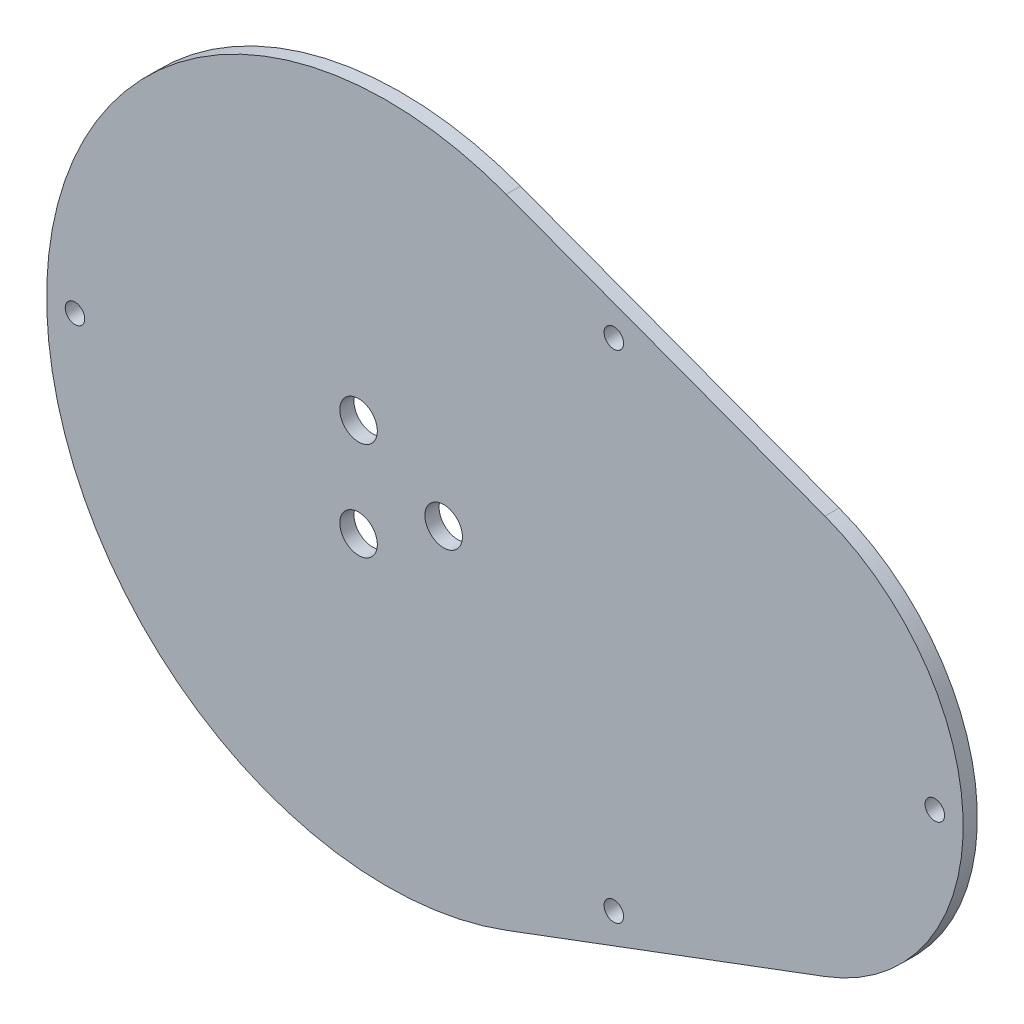
ISO-10303-21;
HEADER;
FILE_DESCRIPTION(('STEP AP214'),'2;1');
FILE_NAME('part.step','',(''),(''),'','','');
FILE_SCHEMA(('AUTOMOTIVE_DESIGN { 1 0 10303 214 1 1 1 1 }'));
ENDSEC;
DATA;
#1=APPLICATION_CONTEXT('core data for automotive mechanical design processes');
#2=APPLICATION_PROTOCOL_DEFINITION('international standard','automotive_design',2000,#1);
#3=PRODUCT_CONTEXT('',#1,'mechanical');
#4=PRODUCT('Part','Part','',(#3));
#5=PRODUCT_RELATED_PRODUCT_CATEGORY('part','',(#4));
#6=PRODUCT_DEFINITION_FORMATION('','',#4);
#7=PRODUCT_DEFINITION_CONTEXT('part definition',#1,'design');
#8=PRODUCT_DEFINITION('design','',#6,#7);
#9=PRODUCT_DEFINITION_SHAPE('','',#8);
#10=(LENGTH_UNIT() NAMED_UNIT(*) SI_UNIT(.MILLI.,.METRE.));
#11=(NAMED_UNIT(*) PLANE_ANGLE_UNIT() SI_UNIT($,.RADIAN.));
#12=(NAMED_UNIT(*) SI_UNIT($,.STERADIAN.) SOLID_ANGLE_UNIT());
#13=UNCERTAINTY_MEASURE_WITH_UNIT(LENGTH_MEASURE(1.E-05),#10,'distance_accuracy_value','');
#14=(GEOMETRIC_REPRESENTATION_CONTEXT(3) GLOBAL_UNCERTAINTY_ASSIGNED_CONTEXT((#13)) GLOBAL_UNIT_ASSIGNED_CONTEXT((#10,
#11,#12)) REPRESENTATION_CONTEXT('',''));
#15=CARTESIAN_POINT('',(0.,0.,0.));
#16=DIRECTION('',(0.,0.,1.));
#17=DIRECTION('',(1.,0.,0.));
#18=AXIS2_PLACEMENT_3D('',#15,#16,#17);
#19=CARTESIAN_POINT('',(0.,0.,1.5875));
#20=DIRECTION('',(0.,0.,1.));
#21=DIRECTION('',(1.,0.,0.));
#22=AXIS2_PLACEMENT_3D('',#19,#20,#21);
#23=PLANE('',#22);
#24=CARTESIAN_POINT('',(-3.175,-5.49926131403118,1.5875));
#25=DIRECTION('',(0.,0.,1.));
#26=DIRECTION('',(1.,0.,0.));
#27=AXIS2_PLACEMENT_3D('',#24,#25,#26);
#28=CIRCLE('',#27,2.1);
#29=CARTESIAN_POINT('',(-1.075,-5.49926131403118,1.5875));
#30=VERTEX_POINT('',#29);
#31=EDGE_CURVE('E141',#30,#30,#28,.T.);
#32=ORIENTED_EDGE('',*,*,#31,.F.);
#33=EDGE_LOOP('',(#32));
#34=FACE_BOUND('',#33,.T.);
#35=CARTESIAN_POINT('',(-34.925,0.,1.5875));
#36=DIRECTION('',(0.,0.,1.));
#37=DIRECTION('',(1.,0.,0.));
#38=AXIS2_PLACEMENT_3D('',#35,#36,#37);
#39=CIRCLE('',#38,1.0922);
#40=CARTESIAN_POINT('',(-33.8328,0.,1.5875));
#41=VERTEX_POINT('',#40);
#42=EDGE_CURVE('E129',#41,#41,#39,.T.);
#43=ORIENTED_EDGE('',*,*,#42,.F.);
#44=EDGE_LOOP('',(#43));
#45=FACE_BOUND('',#44,.T.);
#46=CARTESIAN_POINT('',(25.4,27.7820253658856,1.5875));
#47=DIRECTION('',(0.,0.,1.));
#48=DIRECTION('',(1.,0.,0.));
#49=AXIS2_PLACEMENT_3D('',#46,#47,#48);
#50=CIRCLE('',#49,1.0922);
#51=CARTESIAN_POINT('',(26.4922,27.7820253658856,1.5875));
#52=VERTEX_POINT('',#51);
#53=EDGE_CURVE('E117',#52,#52,#50,.T.);
#54=ORIENTED_EDGE('',*,*,#53,.F.);
#55=EDGE_LOOP('',(#54));
#56=FACE_BOUND('',#55,.T.);
#57=CARTESIAN_POINT('',(0.,0.,1.5875));
#58=DIRECTION('',(0.,0.,1.));
#59=DIRECTION('',(1.,0.,0.));
#60=AXIS2_PLACEMENT_3D('',#57,#58,#59);
#61=CIRCLE('',#60,38.1);
#62=CARTESIAN_POINT('',(13.3608838021391,35.6804818356723,1.5875));
#63=VERTEX_POINT('',#62);
#64=CARTESIAN_POINT('',(13.3608838021391,-35.6804818356722,1.5875));
#65=VERTEX_POINT('',#64);
#66=EDGE_CURVE('E87',#63,#65,#61,.T.);
#67=ORIENTED_EDGE('',*,*,#66,.T.);
#68=DIRECTION('',(0.936495586238117,0.35067936488554,0.));
#69=VECTOR('',#68,1.);
#70=CARTESIAN_POINT('',(13.3608838021391,-35.6804818356722,1.5875));
#71=LINE('',#70,#69);
#72=CARTESIAN_POINT('',(49.0413656378113,-22.3195980335332,1.5875));
#73=VERTEX_POINT('',#72);
#74=EDGE_CURVE('E82',#65,#73,#71,.T.);
#75=ORIENTED_EDGE('',*,*,#74,.T.);
#76=CARTESIAN_POINT('',(40.6835873653681,0.,1.5875));
#77=DIRECTION('',(0.,0.,1.));
#78=DIRECTION('',(1.,0.,0.));
#79=AXIS2_PLACEMENT_3D('',#76,#77,#78);
#80=CIRCLE('',#79,23.8331054214473);
#81=CARTESIAN_POINT('',(49.0413656378113,22.3195980335332,1.5875));
#82=VERTEX_POINT('',#81);
#83=EDGE_CURVE('E85',#73,#82,#80,.T.);
#84=ORIENTED_EDGE('',*,*,#83,.T.);
#85=DIRECTION('',(-0.936495586238117,0.350679364885541,0.));
#86=VECTOR('',#85,1.);
#87=CARTESIAN_POINT('',(13.3608838021391,35.6804818356723,1.5875));
#88=LINE('',#87,#86);
#89=EDGE_CURVE('E52',#82,#63,#88,.T.);
#90=ORIENTED_EDGE('',*,*,#89,.T.);
#91=EDGE_LOOP('',(#67,#75,#84,#90));
#92=FACE_BOUND('',#91,.T.);
#93=CARTESIAN_POINT('',(61.3416927868154,0.,1.5875));
#94=DIRECTION('',(0.,0.,1.));
#95=DIRECTION('',(1.,0.,0.));
#96=AXIS2_PLACEMENT_3D('',#93,#94,#95);
#97=CIRCLE('',#96,1.09219999999999);
#98=CARTESIAN_POINT('',(62.4338927868154,0.,1.5875));
#99=VERTEX_POINT('',#98);
#100=EDGE_CURVE('E102',#99,#99,#97,.T.);
#101=ORIENTED_EDGE('',*,*,#100,.F.);
#102=EDGE_LOOP('',(#101));
#103=FACE_BOUND('',#102,.T.);
#104=CARTESIAN_POINT('',(25.4,-27.7820253658856,1.5875));
#105=DIRECTION('',(0.,0.,1.));
#106=DIRECTION('',(1.,0.,0.));
#107=AXIS2_PLACEMENT_3D('',#104,#105,#106);
#108=CIRCLE('',#107,1.0922);
#109=CARTESIAN_POINT('',(26.4922,-27.7820253658856,1.5875));
#110=VERTEX_POINT('',#109);
#111=EDGE_CURVE('E123',#110,#110,#108,.T.);
#112=ORIENTED_EDGE('',*,*,#111,.F.);
#113=EDGE_LOOP('',(#112));
#114=FACE_BOUND('',#113,.T.);
#115=CARTESIAN_POINT('',(6.35,0.,1.5875));
#116=DIRECTION('',(0.,0.,1.));
#117=DIRECTION('',(1.,0.,0.));
#118=AXIS2_PLACEMENT_3D('',#115,#116,#117);
#119=CIRCLE('',#118,2.1);
#120=CARTESIAN_POINT('',(8.45,0.,1.5875));
#121=VERTEX_POINT('',#120);
#122=EDGE_CURVE('E135',#121,#121,#119,.T.);
#123=ORIENTED_EDGE('',*,*,#122,.F.);
#124=EDGE_LOOP('',(#123));
#125=FACE_BOUND('',#124,.T.);
#126=CARTESIAN_POINT('',(-3.175,5.49926131403119,1.5875));
#127=DIRECTION('',(0.,0.,1.));
#128=DIRECTION('',(1.,0.,0.));
#129=AXIS2_PLACEMENT_3D('',#126,#127,#128);
#130=CIRCLE('',#129,2.1);
#131=CARTESIAN_POINT('',(-1.075,5.49926131403119,1.5875));
#132=VERTEX_POINT('',#131);
#133=EDGE_CURVE('E147',#132,#132,#130,.T.);
#134=ORIENTED_EDGE('',*,*,#133,.F.);
#135=EDGE_LOOP('',(#134));
#136=FACE_BOUND('',#135,.T.);
#137=ADVANCED_FACE('F35',(#34,#45,#56,#92,#103,#114,#125,#136),#23,.T.);
#138=CARTESIAN_POINT('',(0.,0.,0.));
#139=DIRECTION('',(0.,0.,1.));
#140=DIRECTION('',(1.,0.,0.));
#141=AXIS2_PLACEMENT_3D('',#138,#139,#140);
#142=PLANE('',#141);
#143=CARTESIAN_POINT('',(-3.175,-5.49926131403118,0.));
#144=DIRECTION('',(0.,0.,1.));
#145=DIRECTION('',(1.,0.,0.));
#146=AXIS2_PLACEMENT_3D('',#143,#144,#145);
#147=CIRCLE('',#146,2.1);
#148=CARTESIAN_POINT('',(-1.075,-5.49926131403118,0.));
#149=VERTEX_POINT('',#148);
#150=EDGE_CURVE('E144',#149,#149,#147,.T.);
#151=ORIENTED_EDGE('',*,*,#150,.T.);
#152=EDGE_LOOP('',(#151));
#153=FACE_BOUND('',#152,.T.);
#154=CARTESIAN_POINT('',(-34.925,0.,0.));
#155=DIRECTION('',(0.,0.,1.));
#156=DIRECTION('',(1.,0.,0.));
#157=AXIS2_PLACEMENT_3D('',#154,#155,#156);
#158=CIRCLE('',#157,1.0922);
#159=CARTESIAN_POINT('',(-33.8328,0.,0.));
#160=VERTEX_POINT('',#159);
#161=EDGE_CURVE('E132',#160,#160,#158,.T.);
#162=ORIENTED_EDGE('',*,*,#161,.T.);
#163=EDGE_LOOP('',(#162));
#164=FACE_BOUND('',#163,.T.);
#165=CARTESIAN_POINT('',(25.4,27.7820253658856,0.));
#166=DIRECTION('',(0.,0.,1.));
#167=DIRECTION('',(1.,0.,0.));
#168=AXIS2_PLACEMENT_3D('',#165,#166,#167);
#169=CIRCLE('',#168,1.0922);
#170=CARTESIAN_POINT('',(26.4922,27.7820253658856,0.));
#171=VERTEX_POINT('',#170);
#172=EDGE_CURVE('E120',#171,#171,#169,.T.);
#173=ORIENTED_EDGE('',*,*,#172,.T.);
#174=EDGE_LOOP('',(#173));
#175=FACE_BOUND('',#174,.T.);
#176=CARTESIAN_POINT('',(0.,0.,0.));
#177=DIRECTION('',(0.,0.,1.));
#178=DIRECTION('',(1.,0.,0.));
#179=AXIS2_PLACEMENT_3D('',#176,#177,#178);
#180=CIRCLE('',#179,38.1);
#181=CARTESIAN_POINT('',(13.3608838021391,35.6804818356723,0.));
#182=VERTEX_POINT('',#181);
#183=CARTESIAN_POINT('',(13.3608838021391,-35.6804818356722,0.));
#184=VERTEX_POINT('',#183);
#185=EDGE_CURVE('E99',#182,#184,#180,.T.);
#186=ORIENTED_EDGE('',*,*,#185,.F.);
#187=DIRECTION('',(-0.936495586238117,0.350679364885541,0.));
#188=VECTOR('',#187,1.);
#189=CARTESIAN_POINT('',(13.3608838021391,35.6804818356723,0.));
#190=LINE('',#189,#188);
#191=CARTESIAN_POINT('',(49.0413656378113,22.3195980335332,0.));
#192=VERTEX_POINT('',#191);
#193=EDGE_CURVE('E75',#192,#182,#190,.T.);
#194=ORIENTED_EDGE('',*,*,#193,.F.);
#195=CARTESIAN_POINT('',(40.6835873653681,0.,0.));
#196=DIRECTION('',(0.,0.,1.));
#197=DIRECTION('',(1.,0.,0.));
#198=AXIS2_PLACEMENT_3D('',#195,#196,#197);
#199=CIRCLE('',#198,23.8331054214473);
#200=CARTESIAN_POINT('',(49.0413656378113,-22.3195980335332,0.));
#201=VERTEX_POINT('',#200);
#202=EDGE_CURVE('E69',#201,#192,#199,.T.);
#203=ORIENTED_EDGE('',*,*,#202,.F.);
#204=DIRECTION('',(0.936495586238117,0.35067936488554,0.));
#205=VECTOR('',#204,1.);
#206=CARTESIAN_POINT('',(13.3608838021391,-35.6804818356722,0.));
#207=LINE('',#206,#205);
#208=EDGE_CURVE('E91',#184,#201,#207,.T.);
#209=ORIENTED_EDGE('',*,*,#208,.F.);
#210=EDGE_LOOP('',(#186,#194,#203,#209));
#211=FACE_BOUND('',#210,.T.);
#212=CARTESIAN_POINT('',(61.3416927868154,0.,0.));
#213=DIRECTION('',(0.,0.,1.));
#214=DIRECTION('',(1.,0.,0.));
#215=AXIS2_PLACEMENT_3D('',#212,#213,#214);
#216=CIRCLE('',#215,1.09219999999999);
#217=CARTESIAN_POINT('',(62.4338927868154,0.,0.));
#218=VERTEX_POINT('',#217);
#219=EDGE_CURVE('E114',#218,#218,#216,.T.);
#220=ORIENTED_EDGE('',*,*,#219,.T.);
#221=EDGE_LOOP('',(#220));
#222=FACE_BOUND('',#221,.T.);
#223=CARTESIAN_POINT('',(25.4,-27.7820253658856,0.));
#224=DIRECTION('',(0.,0.,1.));
#225=DIRECTION('',(1.,0.,0.));
#226=AXIS2_PLACEMENT_3D('',#223,#224,#225);
#227=CIRCLE('',#226,1.0922);
#228=CARTESIAN_POINT('',(26.4922,-27.7820253658856,0.));
#229=VERTEX_POINT('',#228);
#230=EDGE_CURVE('E126',#229,#229,#227,.T.);
#231=ORIENTED_EDGE('',*,*,#230,.T.);
#232=EDGE_LOOP('',(#231));
#233=FACE_BOUND('',#232,.T.);
#234=CARTESIAN_POINT('',(6.35,0.,0.));
#235=DIRECTION('',(0.,0.,1.));
#236=DIRECTION('',(1.,0.,0.));
#237=AXIS2_PLACEMENT_3D('',#234,#235,#236);
#238=CIRCLE('',#237,2.1);
#239=CARTESIAN_POINT('',(8.45,0.,0.));
#240=VERTEX_POINT('',#239);
#241=EDGE_CURVE('E138',#240,#240,#238,.T.);
#242=ORIENTED_EDGE('',*,*,#241,.T.);
#243=EDGE_LOOP('',(#242));
#244=FACE_BOUND('',#243,.T.);
#245=CARTESIAN_POINT('',(-3.175,5.49926131403119,0.));
#246=DIRECTION('',(0.,0.,1.));
#247=DIRECTION('',(1.,0.,0.));
#248=AXIS2_PLACEMENT_3D('',#245,#246,#247);
#249=CIRCLE('',#248,2.1);
#250=CARTESIAN_POINT('',(-1.075,5.49926131403119,0.));
#251=VERTEX_POINT('',#250);
#252=EDGE_CURVE('E150',#251,#251,#249,.T.);
#253=ORIENTED_EDGE('',*,*,#252,.T.);
#254=EDGE_LOOP('',(#253));
#255=FACE_BOUND('',#254,.T.);
#256=ADVANCED_FACE('F110',(#153,#164,#175,#211,#222,#233,#244,#255),#142,.F.);
#257=CARTESIAN_POINT('',(0.,0.,1.5875));
#258=DIRECTION('',(0.,0.,-1.));
#259=DIRECTION('',(-1.,0.,0.));
#260=AXIS2_PLACEMENT_3D('',#257,#258,#259);
#261=CYLINDRICAL_SURFACE('',#260,38.1);
#262=ORIENTED_EDGE('',*,*,#185,.T.);
#263=DIRECTION('',(0.,0.,-1.));
#264=VECTOR('',#263,1.);
#265=CARTESIAN_POINT('',(13.3608838021391,-35.6804818356722,1.5875));
#266=LINE('',#265,#264);
#267=EDGE_CURVE('E11',#65,#184,#266,.T.);
#268=ORIENTED_EDGE('',*,*,#267,.F.);
#269=ORIENTED_EDGE('',*,*,#66,.F.);
#270=DIRECTION('',(0.,0.,-1.));
#271=VECTOR('',#270,1.);
#272=CARTESIAN_POINT('',(13.3608838021391,35.6804818356723,1.5875));
#273=LINE('',#272,#271);
#274=EDGE_CURVE('E95',#63,#182,#273,.T.);
#275=ORIENTED_EDGE('',*,*,#274,.T.);
#276=EDGE_LOOP('',(#262,#268,#269,#275));
#277=FACE_BOUND('',#276,.T.);
#278=ADVANCED_FACE('F37',(#277),#261,.T.);
#279=CARTESIAN_POINT('',(13.3608838021391,-35.6804818356722,1.5875));
#280=DIRECTION('',(-0.35067936488554,0.936495586238117,0.));
#281=DIRECTION('',(-0.936495586238117,-0.35067936488554,0.));
#282=AXIS2_PLACEMENT_3D('',#279,#280,#281);
#283=PLANE('',#282);
#284=ORIENTED_EDGE('',*,*,#208,.T.);
#285=DIRECTION('',(0.,0.,-1.));
#286=VECTOR('',#285,1.);
#287=CARTESIAN_POINT('',(49.0413656378113,-22.3195980335332,1.5875));
#288=LINE('',#287,#286);
#289=EDGE_CURVE('E44',#73,#201,#288,.T.);
#290=ORIENTED_EDGE('',*,*,#289,.F.);
#291=ORIENTED_EDGE('',*,*,#74,.F.);
#292=ORIENTED_EDGE('',*,*,#267,.T.);
#293=EDGE_LOOP('',(#284,#290,#291,#292));
#294=FACE_BOUND('',#293,.T.);
#295=ADVANCED_FACE('F90',(#294),#283,.F.);
#296=CARTESIAN_POINT('',(40.6835873653681,0.,1.5875));
#297=DIRECTION('',(0.,0.,-1.));
#298=DIRECTION('',(-1.,0.,0.));
#299=AXIS2_PLACEMENT_3D('',#296,#297,#298);
#300=CYLINDRICAL_SURFACE('',#299,23.8331054214473);
#301=ORIENTED_EDGE('',*,*,#202,.T.);
#302=DIRECTION('',(0.,0.,-1.));
#303=VECTOR('',#302,1.);
#304=CARTESIAN_POINT('',(49.0413656378113,22.3195980335332,1.5875));
#305=LINE('',#304,#303);
#306=EDGE_CURVE('E92',#82,#192,#305,.T.);
#307=ORIENTED_EDGE('',*,*,#306,.F.);
#308=ORIENTED_EDGE('',*,*,#83,.F.);
#309=ORIENTED_EDGE('',*,*,#289,.T.);
#310=EDGE_LOOP('',(#301,#307,#308,#309));
#311=FACE_BOUND('',#310,.T.);
#312=ADVANCED_FACE('F93',(#311),#300,.T.);
#313=CARTESIAN_POINT('',(13.3608838021391,35.6804818356723,1.5875));
#314=DIRECTION('',(-0.35067936488554,-0.936495586238117,0.));
#315=DIRECTION('',(0.936495586238117,-0.35067936488554,0.));
#316=AXIS2_PLACEMENT_3D('',#313,#314,#315);
#317=PLANE('',#316);
#318=ORIENTED_EDGE('',*,*,#193,.T.);
#319=ORIENTED_EDGE('',*,*,#274,.F.);
#320=ORIENTED_EDGE('',*,*,#89,.F.);
#321=ORIENTED_EDGE('',*,*,#306,.T.);
#322=EDGE_LOOP('',(#318,#319,#320,#321));
#323=FACE_BOUND('',#322,.T.);
#324=ADVANCED_FACE('F107',(#323),#317,.F.);
#325=CARTESIAN_POINT('',(61.3416927868154,0.,1.5875));
#326=DIRECTION('',(0.,0.,-1.));
#327=DIRECTION('',(-1.,0.,0.));
#328=AXIS2_PLACEMENT_3D('',#325,#326,#327);
#329=CYLINDRICAL_SURFACE('',#328,1.09219999999999);
#330=ORIENTED_EDGE('',*,*,#100,.T.);
#331=EDGE_LOOP('',(#330));
#332=FACE_BOUND('',#331,.T.);
#333=ORIENTED_EDGE('',*,*,#219,.F.);
#334=EDGE_LOOP('',(#333));
#335=FACE_BOUND('',#334,.T.);
#336=ADVANCED_FACE('F170',(#332,#335),#329,.F.);
#337=CARTESIAN_POINT('',(25.4,27.7820253658856,1.5875));
#338=DIRECTION('',(0.,0.,-1.));
#339=DIRECTION('',(-1.,0.,0.));
#340=AXIS2_PLACEMENT_3D('',#337,#338,#339);
#341=CYLINDRICAL_SURFACE('',#340,1.0922);
#342=ORIENTED_EDGE('',*,*,#53,.T.);
#343=EDGE_LOOP('',(#342));
#344=FACE_BOUND('',#343,.T.);
#345=ORIENTED_EDGE('',*,*,#172,.F.);
#346=EDGE_LOOP('',(#345));
#347=FACE_BOUND('',#346,.T.);
#348=ADVANCED_FACE('F216',(#344,#347),#341,.F.);
#349=CARTESIAN_POINT('',(25.4,-27.7820253658856,1.5875));
#350=DIRECTION('',(0.,0.,-1.));
#351=DIRECTION('',(-1.,0.,0.));
#352=AXIS2_PLACEMENT_3D('',#349,#350,#351);
#353=CYLINDRICAL_SURFACE('',#352,1.0922);
#354=ORIENTED_EDGE('',*,*,#111,.T.);
#355=EDGE_LOOP('',(#354));
#356=FACE_BOUND('',#355,.T.);
#357=ORIENTED_EDGE('',*,*,#230,.F.);
#358=EDGE_LOOP('',(#357));
#359=FACE_BOUND('',#358,.T.);
#360=ADVANCED_FACE('F224',(#356,#359),#353,.F.);
#361=CARTESIAN_POINT('',(-34.925,0.,1.5875));
#362=DIRECTION('',(0.,0.,-1.));
#363=DIRECTION('',(-1.,0.,0.));
#364=AXIS2_PLACEMENT_3D('',#361,#362,#363);
#365=CYLINDRICAL_SURFACE('',#364,1.0922);
#366=ORIENTED_EDGE('',*,*,#42,.T.);
#367=EDGE_LOOP('',(#366));
#368=FACE_BOUND('',#367,.T.);
#369=ORIENTED_EDGE('',*,*,#161,.F.);
#370=EDGE_LOOP('',(#369));
#371=FACE_BOUND('',#370,.T.);
#372=ADVANCED_FACE('F232',(#368,#371),#365,.F.);
#373=CARTESIAN_POINT('',(6.35,0.,1.5875));
#374=DIRECTION('',(0.,0.,-1.));
#375=DIRECTION('',(-1.,0.,0.));
#376=AXIS2_PLACEMENT_3D('',#373,#374,#375);
#377=CYLINDRICAL_SURFACE('',#376,2.1);
#378=ORIENTED_EDGE('',*,*,#122,.T.);
#379=EDGE_LOOP('',(#378));
#380=FACE_BOUND('',#379,.T.);
#381=ORIENTED_EDGE('',*,*,#241,.F.);
#382=EDGE_LOOP('',(#381));
#383=FACE_BOUND('',#382,.T.);
#384=ADVANCED_FACE('F241',(#380,#383),#377,.F.);
#385=CARTESIAN_POINT('',(-3.175,-5.49926131403118,1.5875));
#386=DIRECTION('',(0.,0.,-1.));
#387=DIRECTION('',(-1.,0.,0.));
#388=AXIS2_PLACEMENT_3D('',#385,#386,#387);
#389=CYLINDRICAL_SURFACE('',#388,2.1);
#390=ORIENTED_EDGE('',*,*,#31,.T.);
#391=EDGE_LOOP('',(#390));
#392=FACE_BOUND('',#391,.T.);
#393=ORIENTED_EDGE('',*,*,#150,.F.);
#394=EDGE_LOOP('',(#393));
#395=FACE_BOUND('',#394,.T.);
#396=ADVANCED_FACE('F250',(#392,#395),#389,.F.);
#397=CARTESIAN_POINT('',(-3.175,5.49926131403119,1.5875));
#398=DIRECTION('',(0.,0.,-1.));
#399=DIRECTION('',(-1.,0.,0.));
#400=AXIS2_PLACEMENT_3D('',#397,#398,#399);
#401=CYLINDRICAL_SURFACE('',#400,2.1);
#402=ORIENTED_EDGE('',*,*,#133,.T.);
#403=EDGE_LOOP('',(#402));
#404=FACE_BOUND('',#403,.T.);
#405=ORIENTED_EDGE('',*,*,#252,.F.);
#406=EDGE_LOOP('',(#405));
#407=FACE_BOUND('',#406,.T.);
#408=ADVANCED_FACE('F156',(#404,#407),#401,.F.);
#409=CLOSED_SHELL('',(#137,#256,#278,#295,#312,#324,#336,#348,#360,#372,#384,#396,#408));
#410=MANIFOLD_SOLID_BREP('B2',#409);
#411=ADVANCED_BREP_SHAPE_REPRESENTATION('',(#18,#410),#14);
#412=SHAPE_DEFINITION_REPRESENTATION(#9,#411);
ENDSEC;
END-ISO-10303-21;
